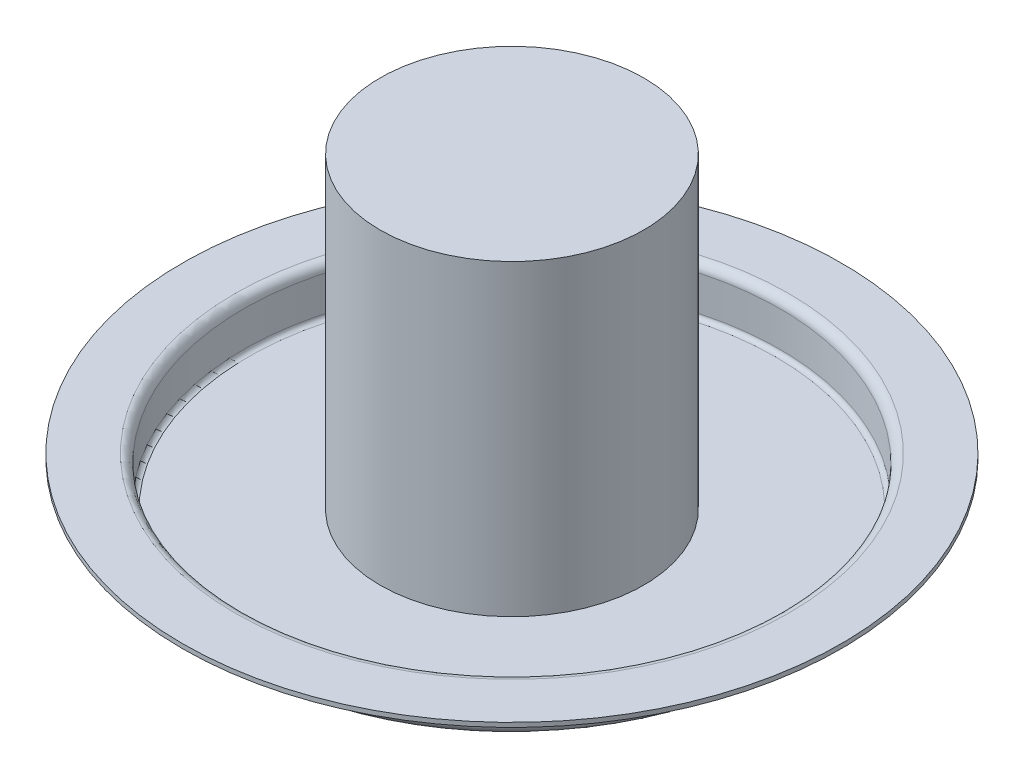
ISO-10303-21;
HEADER;
FILE_DESCRIPTION(('STEP AP214'),'2;1');
FILE_NAME('part.step','',(''),(''),'','','');
FILE_SCHEMA(('AUTOMOTIVE_DESIGN { 1 0 10303 214 1 1 1 1 }'));
ENDSEC;
DATA;
#1=APPLICATION_CONTEXT('core data for automotive mechanical design processes');
#2=APPLICATION_PROTOCOL_DEFINITION('international standard','automotive_design',2000,#1);
#3=PRODUCT_CONTEXT('',#1,'mechanical');
#4=PRODUCT('Part','Part','',(#3));
#5=PRODUCT_RELATED_PRODUCT_CATEGORY('part','',(#4));
#6=PRODUCT_DEFINITION_FORMATION('','',#4);
#7=PRODUCT_DEFINITION_CONTEXT('part definition',#1,'design');
#8=PRODUCT_DEFINITION('design','',#6,#7);
#9=PRODUCT_DEFINITION_SHAPE('','',#8);
#10=(LENGTH_UNIT() NAMED_UNIT(*) SI_UNIT(.MILLI.,.METRE.));
#11=(NAMED_UNIT(*) PLANE_ANGLE_UNIT() SI_UNIT($,.RADIAN.));
#12=(NAMED_UNIT(*) SI_UNIT($,.STERADIAN.) SOLID_ANGLE_UNIT());
#13=UNCERTAINTY_MEASURE_WITH_UNIT(LENGTH_MEASURE(1.E-05),#10,'distance_accuracy_value','');
#14=(GEOMETRIC_REPRESENTATION_CONTEXT(3) GLOBAL_UNCERTAINTY_ASSIGNED_CONTEXT((#13)) GLOBAL_UNIT_ASSIGNED_CONTEXT((#10,
#11,#12)) REPRESENTATION_CONTEXT('',''));
#15=CARTESIAN_POINT('',(0.,0.,0.));
#16=DIRECTION('',(0.,0.,1.));
#17=DIRECTION('',(1.,0.,0.));
#18=AXIS2_PLACEMENT_3D('',#15,#16,#17);
#19=CARTESIAN_POINT('',(0.,0.,0.));
#20=DIRECTION('',(0.,1.,0.));
#21=DIRECTION('',(0.,0.,1.));
#22=AXIS2_PLACEMENT_3D('',#19,#20,#21);
#23=PLANE('',#22);
#24=CARTESIAN_POINT('',(0.,0.,0.));
#25=DIRECTION('',(0.,1.,0.));
#26=DIRECTION('',(0.,0.,1.));
#27=AXIS2_PLACEMENT_3D('',#24,#25,#26);
#28=CIRCLE('',#27,60.);
#29=CARTESIAN_POINT('',(0.,0.,60.));
#30=VERTEX_POINT('',#29);
#31=EDGE_CURVE('E121',#30,#30,#28,.T.);
#32=ORIENTED_EDGE('',*,*,#31,.F.);
#33=EDGE_LOOP('',(#32));
#34=FACE_BOUND('',#33,.T.);
#35=ADVANCED_FACE('F118',(#34),#23,.F.);
#36=CARTESIAN_POINT('',(0.,1.,0.));
#37=DIRECTION('',(0.,1.,0.));
#38=DIRECTION('',(0.,0.,1.));
#39=AXIS2_PLACEMENT_3D('',#36,#37,#38);
#40=CYLINDRICAL_SURFACE('',#39,62.);
#41=DIRECTION('',(0.,1.,0.));
#42=VECTOR('',#41,1.);
#43=CARTESIAN_POINT('',(0.,1.,62.));
#44=LINE('',#43,#42);
#45=CARTESIAN_POINT('',(0.,2.,62.));
#46=VERTEX_POINT('',#45);
#47=CARTESIAN_POINT('',(0.,9.99999999999999,62.));
#48=VERTEX_POINT('',#47);
#49=EDGE_CURVE('E211',#46,#48,#44,.T.);
#50=ORIENTED_EDGE('',*,*,#49,.T.);
#51=CARTESIAN_POINT('',(0.,10.,0.));
#52=DIRECTION('',(0.,1.,0.));
#53=DIRECTION('',(0.,0.,1.));
#54=AXIS2_PLACEMENT_3D('',#51,#52,#53);
#55=CIRCLE('',#54,62.);
#56=EDGE_CURVE('E200',#48,#48,#55,.T.);
#57=ORIENTED_EDGE('',*,*,#56,.F.);
#58=ORIENTED_EDGE('',*,*,#49,.F.);
#59=CARTESIAN_POINT('',(0.,2.,0.));
#60=DIRECTION('',(0.,1.,0.));
#61=DIRECTION('',(0.,0.,1.));
#62=AXIS2_PLACEMENT_3D('',#59,#60,#61);
#63=CIRCLE('',#62,62.);
#64=EDGE_CURVE('E215',#46,#46,#63,.T.);
#65=ORIENTED_EDGE('',*,*,#64,.T.);
#66=EDGE_LOOP('',(#50,#57,#58,#65));
#67=FACE_BOUND('',#66,.T.);
#68=ADVANCED_FACE('F228',(#67),#40,.T.);
#69=CARTESIAN_POINT('',(0.,2.,0.));
#70=DIRECTION('',(0.,1.,0.));
#71=DIRECTION('',(0.,0.,1.));
#72=AXIS2_PLACEMENT_3D('',#69,#70,#71);
#73=TOROIDAL_SURFACE('',#72,60.,2.);
#74=CARTESIAN_POINT('',(0.,2.,60.));
#75=DIRECTION('',(-1.,0.,0.));
#76=DIRECTION('',(0.,0.,1.));
#77=AXIS2_PLACEMENT_3D('',#74,#75,#76);
#78=CIRCLE('',#77,2.);
#79=EDGE_CURVE('E177',#30,#46,#78,.T.);
#80=ORIENTED_EDGE('',*,*,#79,.T.);
#81=ORIENTED_EDGE('',*,*,#64,.F.);
#82=ORIENTED_EDGE('',*,*,#79,.F.);
#83=ORIENTED_EDGE('',*,*,#31,.T.);
#84=EDGE_LOOP('',(#80,#81,#82,#83));
#85=FACE_BOUND('',#84,.T.);
#86=ADVANCED_FACE('F231',(#85),#73,.T.);
#87=CARTESIAN_POINT('',(0.,11.,0.));
#88=DIRECTION('',(0.,1.,0.));
#89=DIRECTION('',(0.,0.,1.));
#90=AXIS2_PLACEMENT_3D('',#87,#88,#89);
#91=CYLINDRICAL_SURFACE('',#90,75.);
#92=CARTESIAN_POINT('',(0.,11.,0.));
#93=DIRECTION('',(0.,1.,0.));
#94=DIRECTION('',(0.,0.,1.));
#95=AXIS2_PLACEMENT_3D('',#92,#93,#94);
#96=CIRCLE('',#95,75.);
#97=CARTESIAN_POINT('',(0.,11.,75.));
#98=VERTEX_POINT('',#97);
#99=EDGE_CURVE('E173',#98,#98,#96,.T.);
#100=ORIENTED_EDGE('',*,*,#99,.T.);
#101=DIRECTION('',(0.,1.,0.));
#102=VECTOR('',#101,1.);
#103=CARTESIAN_POINT('',(0.,11.,75.));
#104=LINE('',#103,#102);
#105=CARTESIAN_POINT('',(0.,12.,75.));
#106=VERTEX_POINT('',#105);
#107=EDGE_CURVE('E160',#98,#106,#104,.T.);
#108=ORIENTED_EDGE('',*,*,#107,.T.);
#109=CARTESIAN_POINT('',(0.,12.,0.));
#110=DIRECTION('',(0.,1.,0.));
#111=DIRECTION('',(0.,0.,1.));
#112=AXIS2_PLACEMENT_3D('',#109,#110,#111);
#113=CIRCLE('',#112,75.);
#114=EDGE_CURVE('E174',#106,#106,#113,.T.);
#115=ORIENTED_EDGE('',*,*,#114,.F.);
#116=ORIENTED_EDGE('',*,*,#107,.F.);
#117=EDGE_LOOP('',(#100,#108,#115,#116));
#118=FACE_BOUND('',#117,.T.);
#119=ADVANCED_FACE('F171',(#118),#91,.T.);
#120=CARTESIAN_POINT('',(0.,12.,62.));
#121=DIRECTION('',(0.,1.,0.));
#122=DIRECTION('',(0.,0.,1.));
#123=AXIS2_PLACEMENT_3D('',#120,#121,#122);
#124=PLANE('',#123);
#125=ORIENTED_EDGE('',*,*,#114,.T.);
#126=EDGE_LOOP('',(#125));
#127=FACE_BOUND('',#126,.T.);
#128=CARTESIAN_POINT('',(0.,12.,0.));
#129=DIRECTION('',(0.,1.,0.));
#130=DIRECTION('',(0.,0.,1.));
#131=AXIS2_PLACEMENT_3D('',#128,#129,#130);
#132=CIRCLE('',#131,63.);
#133=CARTESIAN_POINT('',(0.,12.,63.));
#134=VERTEX_POINT('',#133);
#135=EDGE_CURVE('E323',#134,#134,#132,.T.);
#136=ORIENTED_EDGE('',*,*,#135,.F.);
#137=EDGE_LOOP('',(#136));
#138=FACE_BOUND('',#137,.T.);
#139=ADVANCED_FACE('F239',(#127,#138),#124,.T.);
#140=CARTESIAN_POINT('',(0.,10.,0.));
#141=DIRECTION('',(0.,1.,0.));
#142=DIRECTION('',(0.,0.,1.));
#143=AXIS2_PLACEMENT_3D('',#140,#141,#142);
#144=TOROIDAL_SURFACE('',#143,63.,2.);
#145=CARTESIAN_POINT('',(0.,10.,63.));
#146=DIRECTION('',(-1.,0.,0.));
#147=DIRECTION('',(0.,0.,1.));
#148=AXIS2_PLACEMENT_3D('',#145,#146,#147);
#149=CIRCLE('',#148,2.);
#150=CARTESIAN_POINT('',(0.,10.,61.));
#151=VERTEX_POINT('',#150);
#152=EDGE_CURVE('E141',#151,#134,#149,.F.);
#153=ORIENTED_EDGE('',*,*,#152,.F.);
#154=CARTESIAN_POINT('',(0.,10.,0.));
#155=DIRECTION('',(0.,1.,0.));
#156=DIRECTION('',(0.,0.,1.));
#157=AXIS2_PLACEMENT_3D('',#154,#155,#156);
#158=CIRCLE('',#157,61.);
#159=EDGE_CURVE('E204',#151,#151,#158,.T.);
#160=ORIENTED_EDGE('',*,*,#159,.F.);
#161=ORIENTED_EDGE('',*,*,#152,.T.);
#162=ORIENTED_EDGE('',*,*,#135,.T.);
#163=EDGE_LOOP('',(#153,#160,#161,#162));
#164=FACE_BOUND('',#163,.T.);
#165=ADVANCED_FACE('F309',(#164),#144,.T.);
#166=CARTESIAN_POINT('',(0.,11.,62.));
#167=DIRECTION('',(0.,1.,0.));
#168=DIRECTION('',(0.,0.,1.));
#169=AXIS2_PLACEMENT_3D('',#166,#167,#168);
#170=PLANE('',#169);
#171=CARTESIAN_POINT('',(0.,11.,0.));
#172=DIRECTION('',(0.,1.,0.));
#173=DIRECTION('',(0.,0.,1.));
#174=AXIS2_PLACEMENT_3D('',#171,#172,#173);
#175=CIRCLE('',#174,63.);
#176=CARTESIAN_POINT('',(0.,11.,63.));
#177=VERTEX_POINT('',#176);
#178=EDGE_CURVE('E185',#177,#177,#175,.T.);
#179=ORIENTED_EDGE('',*,*,#178,.T.);
#180=EDGE_LOOP('',(#179));
#181=FACE_BOUND('',#180,.T.);
#182=ORIENTED_EDGE('',*,*,#99,.F.);
#183=EDGE_LOOP('',(#182));
#184=FACE_BOUND('',#183,.T.);
#185=ADVANCED_FACE('F183',(#181,#184),#170,.F.);
#186=CARTESIAN_POINT('',(0.,10.,0.));
#187=DIRECTION('',(0.,1.,0.));
#188=DIRECTION('',(0.,0.,1.));
#189=AXIS2_PLACEMENT_3D('',#186,#187,#188);
#190=TOROIDAL_SURFACE('',#189,63.,1.);
#191=CARTESIAN_POINT('',(0.,10.,63.));
#192=DIRECTION('',(-1.,0.,0.));
#193=DIRECTION('',(0.,0.,1.));
#194=AXIS2_PLACEMENT_3D('',#191,#192,#193);
#195=CIRCLE('',#194,1.);
#196=EDGE_CURVE('E187',#48,#177,#195,.F.);
#197=ORIENTED_EDGE('',*,*,#196,.T.);
#198=ORIENTED_EDGE('',*,*,#178,.F.);
#199=ORIENTED_EDGE('',*,*,#196,.F.);
#200=ORIENTED_EDGE('',*,*,#56,.T.);
#201=EDGE_LOOP('',(#197,#198,#199,#200));
#202=FACE_BOUND('',#201,.T.);
#203=ADVANCED_FACE('F225',(#202),#190,.F.);
#204=CARTESIAN_POINT('',(0.,1.,0.));
#205=DIRECTION('',(0.,1.,0.));
#206=DIRECTION('',(0.,0.,1.));
#207=AXIS2_PLACEMENT_3D('',#204,#205,#206);
#208=PLANE('',#207);
#209=CARTESIAN_POINT('',(0.,1.,0.));
#210=DIRECTION('',(0.,1.,0.));
#211=DIRECTION('',(0.,0.,1.));
#212=AXIS2_PLACEMENT_3D('',#209,#210,#211);
#213=CIRCLE('',#212,30.);
#214=CARTESIAN_POINT('',(0.,1.,30.));
#215=VERTEX_POINT('',#214);
#216=EDGE_CURVE('E335',#215,#215,#213,.T.);
#217=ORIENTED_EDGE('',*,*,#216,.F.);
#218=EDGE_LOOP('',(#217));
#219=FACE_BOUND('',#218,.T.);
#220=CARTESIAN_POINT('',(0.,1.,0.));
#221=DIRECTION('',(0.,1.,0.));
#222=DIRECTION('',(0.,0.,1.));
#223=AXIS2_PLACEMENT_3D('',#220,#221,#222);
#224=CIRCLE('',#223,60.);
#225=CARTESIAN_POINT('',(0.,1.,60.));
#226=VERTEX_POINT('',#225);
#227=EDGE_CURVE('E12',#226,#226,#224,.T.);
#228=ORIENTED_EDGE('',*,*,#227,.T.);
#229=EDGE_LOOP('',(#228));
#230=FACE_BOUND('',#229,.T.);
#231=ADVANCED_FACE('F267',(#219,#230),#208,.T.);
#232=CARTESIAN_POINT('',(0.,2.,0.));
#233=DIRECTION('',(0.,1.,0.));
#234=DIRECTION('',(0.,0.,1.));
#235=AXIS2_PLACEMENT_3D('',#232,#233,#234);
#236=TOROIDAL_SURFACE('',#235,60.,1.);
#237=CARTESIAN_POINT('',(0.,2.,60.));
#238=DIRECTION('',(1.,0.,0.));
#239=DIRECTION('',(0.,0.,-1.));
#240=AXIS2_PLACEMENT_3D('',#237,#238,#239);
#241=CIRCLE('',#240,1.);
#242=CARTESIAN_POINT('',(0.,2.,61.));
#243=VERTEX_POINT('',#242);
#244=EDGE_CURVE('E133',#226,#243,#241,.F.);
#245=ORIENTED_EDGE('',*,*,#244,.F.);
#246=ORIENTED_EDGE('',*,*,#227,.F.);
#247=ORIENTED_EDGE('',*,*,#244,.T.);
#248=CARTESIAN_POINT('',(0.,2.,0.));
#249=DIRECTION('',(0.,1.,0.));
#250=DIRECTION('',(0.,0.,1.));
#251=AXIS2_PLACEMENT_3D('',#248,#249,#250);
#252=CIRCLE('',#251,61.);
#253=EDGE_CURVE('E201',#243,#243,#252,.T.);
#254=ORIENTED_EDGE('',*,*,#253,.T.);
#255=EDGE_LOOP('',(#245,#246,#247,#254));
#256=FACE_BOUND('',#255,.T.);
#257=ADVANCED_FACE('F270',(#256),#236,.F.);
#258=CARTESIAN_POINT('',(0.,1.,0.));
#259=DIRECTION('',(0.,1.,0.));
#260=DIRECTION('',(0.,0.,1.));
#261=AXIS2_PLACEMENT_3D('',#258,#259,#260);
#262=CYLINDRICAL_SURFACE('',#261,61.);
#263=DIRECTION('',(0.,1.,0.));
#264=VECTOR('',#263,1.);
#265=CARTESIAN_POINT('',(0.,1.,61.));
#266=LINE('',#265,#264);
#267=EDGE_CURVE('E199',#243,#151,#266,.T.);
#268=ORIENTED_EDGE('',*,*,#267,.F.);
#269=ORIENTED_EDGE('',*,*,#253,.F.);
#270=ORIENTED_EDGE('',*,*,#267,.T.);
#271=ORIENTED_EDGE('',*,*,#159,.T.);
#272=EDGE_LOOP('',(#268,#269,#270,#271));
#273=FACE_BOUND('',#272,.T.);
#274=ADVANCED_FACE('F280',(#273),#262,.F.);
#275=CARTESIAN_POINT('',(0.,71.,0.));
#276=DIRECTION('',(0.,-1.,0.));
#277=DIRECTION('',(0.,0.,-1.));
#278=AXIS2_PLACEMENT_3D('',#275,#276,#277);
#279=CYLINDRICAL_SURFACE('',#278,30.);
#280=CARTESIAN_POINT('',(0.,71.,0.));
#281=DIRECTION('',(0.,1.,0.));
#282=DIRECTION('',(0.,0.,1.));
#283=AXIS2_PLACEMENT_3D('',#280,#281,#282);
#284=CIRCLE('',#283,30.);
#285=CARTESIAN_POINT('',(0.,71.,30.));
#286=VERTEX_POINT('',#285);
#287=EDGE_CURVE('E192',#286,#286,#284,.T.);
#288=ORIENTED_EDGE('',*,*,#287,.F.);
#289=EDGE_LOOP('',(#288));
#290=FACE_BOUND('',#289,.T.);
#291=ORIENTED_EDGE('',*,*,#216,.T.);
#292=EDGE_LOOP('',(#291));
#293=FACE_BOUND('',#292,.T.);
#294=ADVANCED_FACE('F284',(#290,#293),#279,.T.);
#295=CARTESIAN_POINT('',(0.,71.,0.));
#296=DIRECTION('',(0.,1.,0.));
#297=DIRECTION('',(0.,0.,1.));
#298=AXIS2_PLACEMENT_3D('',#295,#296,#297);
#299=PLANE('',#298);
#300=ORIENTED_EDGE('',*,*,#287,.T.);
#301=EDGE_LOOP('',(#300));
#302=FACE_BOUND('',#301,.T.);
#303=ADVANCED_FACE('F289',(#302),#299,.T.);
#304=CLOSED_SHELL('',(#35,#68,#86,#119,#139,#165,#185,#203,#231,#257,#274,#294,#303));
#305=MANIFOLD_SOLID_BREP('B2',#304);
#306=ADVANCED_BREP_SHAPE_REPRESENTATION('',(#18,#305),#14);
#307=SHAPE_DEFINITION_REPRESENTATION(#9,#306);
ENDSEC;
END-ISO-10303-21;
